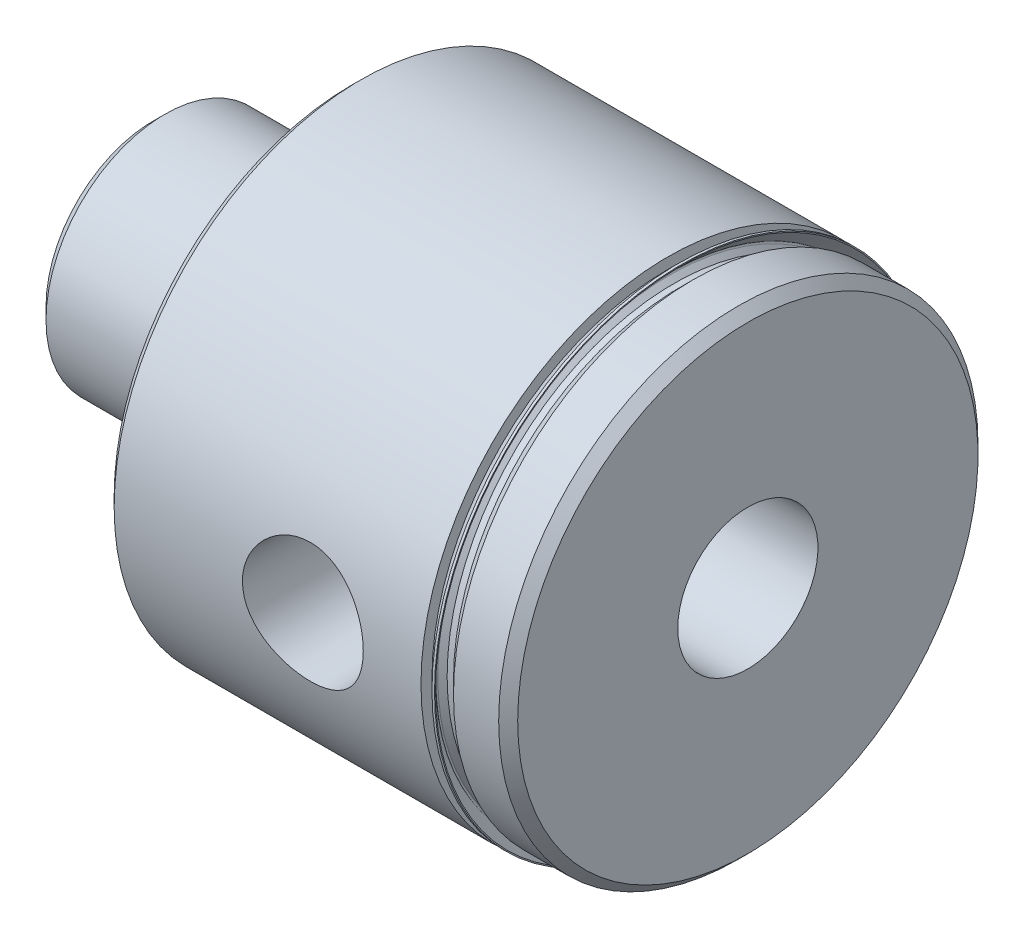
ISO-10303-21;
HEADER;
FILE_DESCRIPTION(('STEP AP214'),'2;1');
FILE_NAME('part.step','',(''),(''),'','','');
FILE_SCHEMA(('AUTOMOTIVE_DESIGN { 1 0 10303 214 1 1 1 1 }'));
ENDSEC;
DATA;
#1=APPLICATION_CONTEXT('core data for automotive mechanical design processes');
#2=APPLICATION_PROTOCOL_DEFINITION('international standard','automotive_design',2000,#1);
#3=PRODUCT_CONTEXT('',#1,'mechanical');
#4=PRODUCT('Part','Part','',(#3));
#5=PRODUCT_RELATED_PRODUCT_CATEGORY('part','',(#4));
#6=PRODUCT_DEFINITION_FORMATION('','',#4);
#7=PRODUCT_DEFINITION_CONTEXT('part definition',#1,'design');
#8=PRODUCT_DEFINITION('design','',#6,#7);
#9=PRODUCT_DEFINITION_SHAPE('','',#8);
#10=(LENGTH_UNIT() NAMED_UNIT(*) SI_UNIT(.MILLI.,.METRE.));
#11=(NAMED_UNIT(*) PLANE_ANGLE_UNIT() SI_UNIT($,.RADIAN.));
#12=(NAMED_UNIT(*) SI_UNIT($,.STERADIAN.) SOLID_ANGLE_UNIT());
#13=UNCERTAINTY_MEASURE_WITH_UNIT(LENGTH_MEASURE(1.E-05),#10,'distance_accuracy_value','');
#14=(GEOMETRIC_REPRESENTATION_CONTEXT(3) GLOBAL_UNCERTAINTY_ASSIGNED_CONTEXT((#13)) GLOBAL_UNIT_ASSIGNED_CONTEXT((#10,
#11,#12)) REPRESENTATION_CONTEXT('',''));
#15=CARTESIAN_POINT('',(0.,0.,0.));
#16=DIRECTION('',(0.,0.,1.));
#17=DIRECTION('',(1.,0.,0.));
#18=AXIS2_PLACEMENT_3D('',#15,#16,#17);
#19=CARTESIAN_POINT('',(41.2115,19.76755,0.));
#20=DIRECTION('',(-1.,0.,0.));
#21=DIRECTION('',(0.,0.,1.));
#22=AXIS2_PLACEMENT_3D('',#19,#20,#21);
#23=PLANE('',#22);
#24=CARTESIAN_POINT('',(41.2115,0.,0.));
#25=DIRECTION('',(-1.,0.,0.));
#26=DIRECTION('',(0.,0.,1.));
#27=AXIS2_PLACEMENT_3D('',#24,#25,#26);
#28=CIRCLE('',#27,19.76755);
#29=CARTESIAN_POINT('',(41.2115,0.,19.76755));
#30=VERTEX_POINT('',#29);
#31=EDGE_CURVE('E120',#30,#30,#28,.T.);
#32=ORIENTED_EDGE('',*,*,#31,.F.);
#33=EDGE_LOOP('',(#32));
#34=FACE_BOUND('',#33,.T.);
#35=CARTESIAN_POINT('',(41.2115,0.,0.));
#36=DIRECTION('',(-1.,0.,0.));
#37=DIRECTION('',(0.,0.,1.));
#38=AXIS2_PLACEMENT_3D('',#35,#36,#37);
#39=CIRCLE('',#38,18.888259175245);
#40=CARTESIAN_POINT('',(41.2115,0.,18.888259175245));
#41=VERTEX_POINT('',#40);
#42=EDGE_CURVE('E10',#41,#41,#39,.F.);
#43=ORIENTED_EDGE('',*,*,#42,.F.);
#44=EDGE_LOOP('',(#43));
#45=FACE_BOUND('',#44,.T.);
#46=ADVANCED_FACE('F36',(#34,#45),#23,.F.);
#47=CARTESIAN_POINT('',(47.625,0.,0.));
#48=DIRECTION('',(-1.,0.,0.));
#49=DIRECTION('',(0.,0.,1.));
#50=AXIS2_PLACEMENT_3D('',#47,#48,#49);
#51=CYLINDRICAL_SURFACE('',#50,18.18005);
#52=CARTESIAN_POINT('',(42.2275,0.,0.));
#53=DIRECTION('',(-1.,0.,0.));
#54=DIRECTION('',(0.,0.,1.));
#55=AXIS2_PLACEMENT_3D('',#52,#53,#54);
#56=CIRCLE('',#55,18.18005);
#57=CARTESIAN_POINT('',(42.2275,0.,18.18005));
#58=VERTEX_POINT('',#57);
#59=EDGE_CURVE('E123',#58,#58,#56,.T.);
#60=ORIENTED_EDGE('',*,*,#59,.T.);
#61=EDGE_LOOP('',(#60));
#62=FACE_BOUND('',#61,.T.);
#63=CARTESIAN_POINT('',(41.7195,0.,0.));
#64=DIRECTION('',(-1.,0.,0.));
#65=DIRECTION('',(0.,0.,1.));
#66=AXIS2_PLACEMENT_3D('',#63,#64,#65);
#67=CIRCLE('',#66,18.18005);
#68=CARTESIAN_POINT('',(41.7195,0.,18.18005));
#69=VERTEX_POINT('',#68);
#70=EDGE_CURVE('E43',#69,#69,#67,.T.);
#71=ORIENTED_EDGE('',*,*,#70,.F.);
#72=EDGE_LOOP('',(#71));
#73=FACE_BOUND('',#72,.T.);
#74=ADVANCED_FACE('F110',(#62,#73),#51,.T.);
#75=CARTESIAN_POINT('',(47.625,0.,0.));
#76=DIRECTION('',(-1.,0.,0.));
#77=DIRECTION('',(0.,0.,1.));
#78=AXIS2_PLACEMENT_3D('',#75,#76,#77);
#79=CYLINDRICAL_SURFACE('',#78,19.76755);
#80=CARTESIAN_POINT('',(16.637,0.,0.));
#81=DIRECTION('',(-1.,0.,0.));
#82=DIRECTION('',(0.,0.,1.));
#83=AXIS2_PLACEMENT_3D('',#80,#81,#82);
#84=CIRCLE('',#83,19.76755);
#85=CARTESIAN_POINT('',(16.637,0.,19.76755));
#86=VERTEX_POINT('',#85);
#87=EDGE_CURVE('E122',#86,#86,#84,.T.);
#88=ORIENTED_EDGE('',*,*,#87,.F.);
#89=EDGE_LOOP('',(#88));
#90=FACE_BOUND('',#89,.T.);
#91=ORIENTED_EDGE('',*,*,#31,.T.);
#92=EDGE_LOOP('',(#91));
#93=FACE_BOUND('',#92,.T.);
#94=CARTESIAN_POINT('',(28.435365081816,-3.51265650317575,19.4529503493223));
#95=CARTESIAN_POINT('',(28.6329278280783,-3.69763911428528,19.4195484578315));
#96=CARTESIAN_POINT('',(28.8461523832951,-3.8660805131461,19.3864045251385));
#97=CARTESIAN_POINT('',(29.2982767694255,-4.16526039848003,19.3243394024906));
#98=CARTESIAN_POINT('',(29.5371903557272,-4.29597854636476,19.2954204946016));
#99=CARTESIAN_POINT('',(30.0344111976161,-4.51592878148575,19.2451350457812));
#100=CARTESIAN_POINT('',(30.2927327479368,-4.60512993491552,19.2237741390568));
#101=CARTESIAN_POINT('',(30.8212362958428,-4.73902603586449,19.1912083718852));
#102=CARTESIAN_POINT('',(31.091414940882,-4.78373348022602,19.1800006598137));
#103=CARTESIAN_POINT('',(31.630627161756,-4.82676103183334,19.1692174197079));
#104=CARTESIAN_POINT('',(31.8995893709715,-4.82592441675557,19.1694304285267));
#105=CARTESIAN_POINT('',(32.4334566613178,-4.77998645132883,19.1809360417537));
#106=CARTESIAN_POINT('',(32.6983617925494,-4.73488564804683,19.1922285092294));
#107=CARTESIAN_POINT('',(33.2141373097179,-4.60252491595889,19.2243941628857));
#108=CARTESIAN_POINT('',(33.4651152033048,-4.5156604777289,19.2451773832846));
#109=CARTESIAN_POINT('',(33.9489993997335,-4.3025515462851,19.2939361087814));
#110=CARTESIAN_POINT('',(34.1819033976118,-4.17630204056709,19.321912529272));
#111=CARTESIAN_POINT('',(34.6282945618301,-3.88488055179608,19.3826282081787));
#112=CARTESIAN_POINT('',(34.8412767286942,-3.71895317869879,19.415454475128));
#113=CARTESIAN_POINT('',(35.2366729936586,-3.35406634411163,19.4818015571243));
#114=CARTESIAN_POINT('',(35.4190833363315,-3.15510283044633,19.5153224569323));
#115=CARTESIAN_POINT('',(35.7511715111366,-2.72568801269662,19.5799514409178));
#116=CARTESIAN_POINT('',(35.9002527135169,-2.49476691186133,19.611009962086));
#117=CARTESIAN_POINT('',(36.1572439441031,-2.01031843546389,19.6665706414187));
#118=CARTESIAN_POINT('',(36.2651587711716,-1.756793699115,19.6910735636855));
#119=CARTESIAN_POINT('',(36.4349032225895,-1.23859032196555,19.7303904621238));
#120=CARTESIAN_POINT('',(36.4974498136582,-0.974158321983477,19.7453546987443));
#121=CARTESIAN_POINT('',(36.5771093875624,-0.43817138420285,19.7645106115859));
#122=CARTESIAN_POINT('',(36.5942308239995,-0.166617781232319,19.7687042921982));
#123=CARTESIAN_POINT('',(36.5826094638717,0.368142985725246,19.7658827120028));
#124=CARTESIAN_POINT('',(36.5550815152975,0.631379071573977,19.7591643460427));
#125=CARTESIAN_POINT('',(36.4573784979057,1.1493417179025,19.7358121128105));
#126=CARTESIAN_POINT('',(36.3872032393555,1.40406824051897,19.7191782014254));
#127=CARTESIAN_POINT('',(36.20639161497,1.89822862606427,19.677762892548));
#128=CARTESIAN_POINT('',(36.0957215972578,2.13764957483144,19.6529747204527));
#129=CARTESIAN_POINT('',(35.837207806796,2.59480171047055,19.5978601353498));
#130=CARTESIAN_POINT('',(35.6893581937111,2.81252948217283,19.5675328524392));
#131=CARTESIAN_POINT('',(35.356034329401,3.22643047339813,19.5036218391906));
#132=CARTESIAN_POINT('',(35.1696504349527,3.42186124178595,19.4699722082067));
#133=CARTESIAN_POINT('',(34.7668632401047,3.77912170302543,19.4037975687667));
#134=CARTESIAN_POINT('',(34.5504563796814,3.94094740540965,19.3712726942526));
#135=CARTESIAN_POINT('',(34.0895860496967,4.22894103774358,19.3104679954526));
#136=CARTESIAN_POINT('',(33.8447283307059,4.3544955777866,19.2822646045092));
#137=CARTESIAN_POINT('',(33.3366256252978,4.56262704775068,19.2340833038405));
#138=CARTESIAN_POINT('',(33.0733832244848,4.64521000740383,19.2141042401674));
#139=CARTESIAN_POINT('',(32.5406394056792,4.76371146458682,19.1850666945539));
#140=CARTESIAN_POINT('',(32.2713163473849,4.80038744704197,19.1758311259643));
#141=CARTESIAN_POINT('',(31.7301931801441,4.82834722752884,19.1688112712599));
#142=CARTESIAN_POINT('',(31.4583934012672,4.81963698830482,19.1710254808974));
#143=CARTESIAN_POINT('',(30.9258578691795,4.75777986051021,19.1864668890865));
#144=CARTESIAN_POINT('',(30.6650095220289,4.70553893930104,19.1994695336789));
#145=CARTESIAN_POINT('',(30.1558920557396,4.55946875033867,19.2346788846883));
#146=CARTESIAN_POINT('',(29.9076238683241,4.46563640720602,19.2568862717203));
#147=CARTESIAN_POINT('',(29.4277871838305,4.2379864197375,19.3082674520253));
#148=CARTESIAN_POINT('',(29.1964171578653,4.10376666251472,19.3375106807538));
#149=CARTESIAN_POINT('',(28.7591799812249,3.79940157683792,19.3996041291334));
#150=CARTESIAN_POINT('',(28.5533168737152,3.62925056436098,19.4324549190753));
#151=CARTESIAN_POINT('',(28.1678199863334,3.25295244141874,19.499016030879));
#152=CARTESIAN_POINT('',(27.9889295753611,3.04604306859441,19.5327281525631));
#153=CARTESIAN_POINT('',(27.6684203590344,2.60460345340952,19.5964722725483));
#154=CARTESIAN_POINT('',(27.526801331945,2.37007337538216,19.6265042927425));
#155=CARTESIAN_POINT('',(27.2853814922027,1.88028127444305,19.6794573161784));
#156=CARTESIAN_POINT('',(27.1854868457201,1.62506732901444,19.7023942450575));
#157=CARTESIAN_POINT('',(27.0303815768316,1.10076483356896,19.7386246450477));
#158=CARTESIAN_POINT('',(26.9751611196866,0.831679351165157,19.7519202385707));
#159=CARTESIAN_POINT('',(26.9122213961598,0.295282285694851,19.7671149914487));
#160=CARTESIAN_POINT('',(26.9032268815798,0.0281285750742939,19.7693200706738));
#161=CARTESIAN_POINT('',(26.9296091709244,-0.50385988489081,19.7629175554801));
#162=CARTESIAN_POINT('',(26.9649869116482,-0.768694585156912,19.7543097327762));
#163=CARTESIAN_POINT('',(27.0781356723665,-1.28492103944122,19.7274177433937));
#164=CARTESIAN_POINT('',(27.1553431250623,-1.5364437690449,19.7092623041115));
#165=CARTESIAN_POINT('',(27.3493194364399,-2.02291155997901,19.6652868574562));
#166=CARTESIAN_POINT('',(27.4660727854644,-2.25786307685637,19.6394698553918));
#167=CARTESIAN_POINT('',(27.71549644764,-2.67173781743904,19.5871061222848));
#168=CARTESIAN_POINT('',(27.8431733101079,-2.85378481366746,19.5612462333185));
#169=CARTESIAN_POINT('',(28.122183547356,-3.19847479248924,19.5078500664681));
#170=CARTESIAN_POINT('',(28.2735189032132,-3.3611161481115,19.4803136483155));
#171=CARTESIAN_POINT('',(28.435365081816,-3.51265650317575,19.4529503493223));
#172=B_SPLINE_CURVE_WITH_KNOTS('',3,(#94,#95,#96,#97,#98,#99,#100,#101,#102,#103,#104,#105,#106,
#107,#108,#109,#110,#111,#112,#113,#114,#115,#116,#117,#118,#119,#120,#121,#122,#123,#124,#125,
#126,#127,#128,#129,#130,#131,#132,#133,#134,#135,#136,#137,#138,#139,#140,#141,#142,#143,#144,
#145,#146,#147,#148,#149,#150,#151,#152,#153,#154,#155,#156,#157,#158,#159,#160,#161,#162,#163,
#164,#165,#166,#167,#168,#169,#170,#171),.UNSPECIFIED.,.T.,.F.,(4,2,2,2,2,2,2,2,2,2,2,2,2,2,2,2,
2,2,2,2,2,2,2,2,2,2,2,2,2,2,2,2,2,2,2,2,2,2,4),(0.,0.817314073620869,1.63506798447687,
2.4534302222361,3.27156254361548,4.07455186240763,4.8775312570733,5.67305209525232,
6.46867422002776,7.28085528321948,8.09313604130971,8.91896356729549,9.74469479515468,
10.5570742328157,11.369302476408,12.1597994363369,12.9502999131154,13.7414588075947,
14.532742058532,15.3454316232512,16.1582176364985,16.9840368466382,17.8097401473271,
18.6216312588531,19.4334157085595,20.2287152433845,21.0240735945681,21.8276287134212,
22.6313110432991,23.4541767979964,24.2770376571882,25.0980378916828,25.918857338973,
26.7169061884853,27.5149718869051,28.3025434253844,29.0898064401128,29.7593055255743,
30.4288607025318),.UNSPECIFIED.);
#173=CARTESIAN_POINT('',(28.435365081816,-3.51265650317575,19.4529503493223));
#174=VERTEX_POINT('',#173);
#175=EDGE_CURVE('E47',#174,#174,#172,.T.);
#176=ORIENTED_EDGE('',*,*,#175,.F.);
#177=EDGE_LOOP('',(#176));
#178=FACE_BOUND('',#177,.T.);
#179=ADVANCED_FACE('F64',(#90,#93,#178),#79,.T.);
#180=CARTESIAN_POINT('',(47.625,0.,0.));
#181=DIRECTION('',(-1.,0.,0.));
#182=DIRECTION('',(0.,0.,1.));
#183=AXIS2_PLACEMENT_3D('',#180,#181,#182);
#184=CYLINDRICAL_SURFACE('',#183,5.6134);
#185=CARTESIAN_POINT('',(47.625,0.,0.));
#186=DIRECTION('',(-1.,0.,0.));
#187=DIRECTION('',(0.,0.,1.));
#188=AXIS2_PLACEMENT_3D('',#185,#186,#187);
#189=CIRCLE('',#188,5.6134);
#190=CARTESIAN_POINT('',(47.625,0.,5.6134));
#191=VERTEX_POINT('',#190);
#192=EDGE_CURVE('E485',#191,#191,#189,.T.);
#193=ORIENTED_EDGE('',*,*,#192,.F.);
#194=EDGE_LOOP('',(#193));
#195=FACE_BOUND('',#194,.T.);
#196=CARTESIAN_POINT('',(0.761999999999999,0.,0.));
#197=DIRECTION('',(-1.,0.,0.));
#198=DIRECTION('',(0.,0.,1.));
#199=AXIS2_PLACEMENT_3D('',#196,#197,#198);
#200=CIRCLE('',#199,5.6134);
#201=CARTESIAN_POINT('',(0.761999999999999,0.,5.6134));
#202=VERTEX_POINT('',#201);
#203=EDGE_CURVE('E488',#202,#202,#200,.T.);
#204=ORIENTED_EDGE('',*,*,#203,.T.);
#205=EDGE_LOOP('',(#204));
#206=FACE_BOUND('',#205,.T.);
#207=CARTESIAN_POINT('',(34.925,0.,5.6134));
#208=CARTESIAN_POINT('',(34.9249998579023,0.0821623693349804,5.61339995699838));
#209=CARTESIAN_POINT('',(34.9218051359041,0.164320513889019,5.61159065214013));
#210=CARTESIAN_POINT('',(34.9090814661473,0.327995279330299,5.60440967825438));
#211=CARTESIAN_POINT('',(34.8995504492879,0.409511681857266,5.59903684556736));
#212=CARTESIAN_POINT('',(34.8616097743609,0.652081627692676,5.57774779539357));
#213=CARTESIAN_POINT('',(34.8238521366127,0.811338029816947,5.55666060930794));
#214=CARTESIAN_POINT('',(34.7254246715626,1.1196591009717,5.50282798498081));
#215=CARTESIAN_POINT('',(34.6648395967703,1.2687590894302,5.47012569612708));
#216=CARTESIAN_POINT('',(34.5230636232286,1.55440526348606,5.39591227930169));
#217=CARTESIAN_POINT('',(34.4418675936104,1.69094831162539,5.35439895834356));
#218=CARTESIAN_POINT('',(34.2547143605698,1.95845765966252,5.26270844927263));
#219=CARTESIAN_POINT('',(34.1474069572226,2.08833692764613,5.21212508879652));
#220=CARTESIAN_POINT('',(33.9140569239964,2.32930354211221,5.10899359943267));
#221=CARTESIAN_POINT('',(33.7879945230462,2.44037078994657,5.05644344148403));
#222=CARTESIAN_POINT('',(33.504882480484,2.65245775268943,4.94876899543653));
#223=CARTESIAN_POINT('',(33.3459646844461,2.7511649183057,4.89396219071688));
#224=CARTESIAN_POINT('',(33.0106076339825,2.92003380267968,4.79513183911936));
#225=CARTESIAN_POINT('',(32.8341947885826,2.99023775531915,4.75109237682188));
#226=CARTESIAN_POINT('',(32.5081085203762,3.08677877117435,4.68877513505459));
#227=CARTESIAN_POINT('',(32.3609482301036,3.11933139320781,4.66697971465572));
#228=CARTESIAN_POINT('',(32.062174173554,3.16321149440602,4.6373576092683));
#229=CARTESIAN_POINT('',(31.9105651976561,3.17456101071162,4.62951642155263));
#230=CARTESIAN_POINT('',(31.6070694166165,3.17541450648967,4.62893102770911));
#231=CARTESIAN_POINT('',(31.4551825021945,3.16489092366436,4.63620586929009));
#232=CARTESIAN_POINT('',(31.1557383283429,3.12255993267885,4.66481557633946));
#233=CARTESIAN_POINT('',(31.0081840539181,3.09073819423309,4.68615990820008));
#234=CARTESIAN_POINT('',(30.7213592656859,3.00745687900315,4.74002995044834));
#235=CARTESIAN_POINT('',(30.5820705370745,2.95604248858711,4.77252991570124));
#236=CARTESIAN_POINT('',(30.3136541723933,2.83535200958952,4.84520308215602));
#237=CARTESIAN_POINT('',(30.1845304845011,2.76606902495452,4.88537924428915));
#238=CARTESIAN_POINT('',(29.9185539754628,2.59900192815599,4.97652910443213));
#239=CARTESIAN_POINT('',(29.7836777474499,2.49844939981214,5.02820730750219));
#240=CARTESIAN_POINT('',(29.531461845307,2.27747390969321,5.1320877118306));
#241=CARTESIAN_POINT('',(29.4141368708698,2.15703446766699,5.184290313675));
#242=CARTESIAN_POINT('',(29.1874224378805,1.88376954375588,5.29011416577329));
#243=CARTESIAN_POINT('',(29.0802977235085,1.72884386148078,5.34326809463976));
#244=CARTESIAN_POINT('',(28.94070761533,1.48238030822901,5.41481160729082));
#245=CARTESIAN_POINT('',(28.8976811279881,1.39784437015664,5.43730202634795));
#246=CARTESIAN_POINT('',(28.8191226254188,1.22458602807581,5.47891971352667));
#247=CARTESIAN_POINT('',(28.783586095122,1.13586618589834,5.49804900662658));
#248=CARTESIAN_POINT('',(28.7226722308014,0.961180402024894,5.53116102266396));
#249=CARTESIAN_POINT('',(28.696761149947,0.87545038183479,5.54540871504812));
#250=CARTESIAN_POINT('',(28.6521959792515,0.701626536182391,5.57006998084775));
#251=CARTESIAN_POINT('',(28.6335380099381,0.613534001388016,5.58048560376228));
#252=CARTESIAN_POINT('',(28.6037525571766,0.435737446747216,5.59717370826138));
#253=CARTESIAN_POINT('',(28.5926210004367,0.346034325578978,5.60344843085562));
#254=CARTESIAN_POINT('',(28.5780437509341,0.165839982664669,5.61167630889777));
#255=CARTESIAN_POINT('',(28.5745972374804,0.0753488461075207,5.61362992579932));
#256=CARTESIAN_POINT('',(28.5758093772984,-0.174583996889071,5.61293847555329));
#257=CARTESIAN_POINT('',(28.5886358891678,-0.334071783644838,5.60566022957548));
#258=CARTESIAN_POINT('',(28.6377820254482,-0.648103262439577,5.57809452559714));
#259=CARTESIAN_POINT('',(28.674102193285,-0.802646840028516,5.55780676667696));
#260=CARTESIAN_POINT('',(28.7681869112593,-1.10172711361315,5.50629732611813));
#261=CARTESIAN_POINT('',(28.8257832746561,-1.24633201539081,5.47516150446489));
#262=CARTESIAN_POINT('',(28.9603655920564,-1.52393967562467,5.40448155117352));
#263=CARTESIAN_POINT('',(29.037356403376,-1.65693951635579,5.36493531354388));
#264=CARTESIAN_POINT('',(29.2175639746098,-1.92243070943738,5.27599210831586));
#265=CARTESIAN_POINT('',(29.322673637778,-2.05343578030353,5.22599869425569));
#266=CARTESIAN_POINT('',(29.5516887816742,-2.29696386299473,5.12364194197683));
#267=CARTESIAN_POINT('',(29.6756155030866,-2.40946568556823,5.07127597308856));
#268=CARTESIAN_POINT('',(29.9544974447345,-2.625094802698,4.96338330060658));
#269=CARTESIAN_POINT('',(30.1113564524656,-2.72591153444098,4.90812262432982));
#270=CARTESIAN_POINT('',(30.4428125411621,-2.89944000724207,4.80766134429477));
#271=CARTESIAN_POINT('',(30.6173849857137,-2.97219012547718,4.76244703968003));
#272=CARTESIAN_POINT('',(30.9415942277655,-3.07401157882498,4.69718724903205));
#273=CARTESIAN_POINT('',(31.0886836484926,-3.10906992450446,4.67383958626922));
#274=CARTESIAN_POINT('',(31.3878077894682,-3.15790146031213,4.64099309224391));
#275=CARTESIAN_POINT('',(31.5398369506483,-3.17169778517904,4.63147920938677));
#276=CARTESIAN_POINT('',(31.8447547230325,-3.17725338732108,4.62767071186645));
#277=CARTESIAN_POINT('',(31.9976443607764,-3.16897484778946,4.63340221427744));
#278=CARTESIAN_POINT('',(32.2994761100531,-3.13079490920484,4.65927981058093));
#279=CARTESIAN_POINT('',(32.448415640636,-3.10087971711801,4.67943509932923));
#280=CARTESIAN_POINT('',(32.7368248367288,-3.02141291547972,4.73112132971286));
#281=CARTESIAN_POINT('',(32.8763856719801,-2.97209774057715,4.76251490624142));
#282=CARTESIAN_POINT('',(33.1456249813082,-2.8555915344253,4.83326937464131));
#283=CARTESIAN_POINT('',(33.2752997080469,-2.78839376767878,4.87263326720189));
#284=CARTESIAN_POINT('',(33.5422084997231,-2.62613578705629,4.96220653197006));
#285=CARTESIAN_POINT('',(33.677561882322,-2.52838526398892,5.01315372940073));
#286=CARTESIAN_POINT('',(33.9312040900675,-2.31315811275706,5.11603656683268));
#287=CARTESIAN_POINT('',(34.0494788070713,-2.1956653475302,5.16797298436634));
#288=CARTESIAN_POINT('',(34.2796251062276,-1.92775741716748,5.27418452421595));
#289=CARTESIAN_POINT('',(34.3891364595098,-1.77509997176914,5.3280246204245));
#290=CARTESIAN_POINT('',(34.5326571593358,-1.53177908465099,5.4010314552227));
#291=CARTESIAN_POINT('',(34.5770561452431,-1.44823905178625,5.42408413489763));
#292=CARTESIAN_POINT('',(34.6584746076697,-1.27686406563405,5.4669604093337));
#293=CARTESIAN_POINT('',(34.6954983511241,-1.18903163255535,5.48678586997627));
#294=CARTESIAN_POINT('',(34.7606515248021,-1.01251042042715,5.52204053165217));
#295=CARTESIAN_POINT('',(34.7890232695167,-0.923934681391812,5.53758800601035));
#296=CARTESIAN_POINT('',(34.8379811829612,-0.744093029789211,5.56460645282066));
#297=CARTESIAN_POINT('',(34.8585716140312,-0.652828619605574,5.5760796568118));
#298=CARTESIAN_POINT('',(34.891646678541,-0.46845248086365,5.59458580978861));
#299=CARTESIAN_POINT('',(34.9041361845415,-0.375341897546174,5.60162142783206));
#300=CARTESIAN_POINT('',(34.9208123777646,-0.188152276859621,5.6110282392154));
#301=CARTESIAN_POINT('',(34.9250001626974,-0.0940733691828537,5.61340004923552));
#302=CARTESIAN_POINT('',(34.925,0.,5.6134));
#303=B_SPLINE_CURVE_WITH_KNOTS('',3,(#207,#208,#209,#210,#211,#212,#213,#214,#215,#216,#217,
#218,#219,#220,#221,#222,#223,#224,#225,#226,#227,#228,#229,#230,#231,#232,#233,#234,#235,#236,
#237,#238,#239,#240,#241,#242,#243,#244,#245,#246,#247,#248,#249,#250,#251,#252,#253,#254,#255,
#256,#257,#258,#259,#260,#261,#262,#263,#264,#265,#266,#267,#268,#269,#270,#271,#272,#273,#274,
#275,#276,#277,#278,#279,#280,#281,#282,#283,#284,#285,#286,#287,#288,#289,#290,#291,#292,#293,
#294,#295,#296,#297,#298,#299,#300,#301,#302),.UNSPECIFIED.,.T.,.F.,(4,2,2,2,2,2,2,2,2,2,2,2,2,
2,2,2,2,2,2,2,2,2,2,2,2,2,2,2,2,2,2,2,2,2,2,2,2,2,2,2,2,2,2,2,2,2,2,4),(0.,0.246389107575224,
0.49285871242746,0.985259173450996,1.47584920765582,1.96656148878411,2.49216874007467,
3.01833405240715,3.60026598356831,4.18133247771155,4.63620867252141,5.09061183476255,
5.54558793766704,6.00087047559118,6.45510929250011,6.90952367749083,7.43538208138259,
7.96167847067522,8.54543274549417,8.83753694560908,9.12946455367089,9.40114046431933,
9.67267086306319,9.94405419177241,10.2154085378833,10.693342364036,11.1712872455506,
11.6455321524318,12.1198959516685,12.643507174172,13.1677139040996,13.7483150461528,
14.3281194593634,14.7851501714349,15.2416832464326,15.6989989178594,16.1566063782507,
16.608801484326,17.061167151824,17.5827687787249,18.1047988489815,18.6877837852989,
18.9795590964415,19.2711651080098,19.5536352357359,19.8359504108384,20.118095620585,
20.4002035206756),.UNSPECIFIED.);
#304=CARTESIAN_POINT('',(34.925,0.,5.6134));
#305=VERTEX_POINT('',#304);
#306=EDGE_CURVE('E58',#305,#305,#303,.T.);
#307=ORIENTED_EDGE('',*,*,#306,.T.);
#308=EDGE_LOOP('',(#307));
#309=FACE_BOUND('',#308,.T.);
#310=ADVANCED_FACE('F84',(#195,#206,#309),#184,.F.);
#311=CARTESIAN_POINT('',(0.,0.,0.));
#312=DIRECTION('',(1.,0.,0.));
#313=DIRECTION('',(0.,0.,-1.));
#314=AXIS2_PLACEMENT_3D('',#311,#312,#313);
#315=PLANE('',#314);
#316=CARTESIAN_POINT('',(0.,0.,0.));
#317=DIRECTION('',(-1.,0.,0.));
#318=DIRECTION('',(0.,0.,1.));
#319=AXIS2_PLACEMENT_3D('',#316,#317,#318);
#320=CIRCLE('',#319,8.58901);
#321=CARTESIAN_POINT('',(0.,0.,8.58901));
#322=VERTEX_POINT('',#321);
#323=EDGE_CURVE('E138',#322,#322,#320,.T.);
#324=ORIENTED_EDGE('',*,*,#323,.T.);
#325=EDGE_LOOP('',(#324));
#326=FACE_BOUND('',#325,.T.);
#327=CARTESIAN_POINT('',(0.,0.,0.));
#328=DIRECTION('',(-1.,0.,0.));
#329=DIRECTION('',(0.,0.,1.));
#330=AXIS2_PLACEMENT_3D('',#327,#328,#329);
#331=CIRCLE('',#330,6.3754);
#332=CARTESIAN_POINT('',(0.,0.,6.3754));
#333=VERTEX_POINT('',#332);
#334=EDGE_CURVE('E491',#333,#333,#331,.T.);
#335=ORIENTED_EDGE('',*,*,#334,.F.);
#336=EDGE_LOOP('',(#335));
#337=FACE_BOUND('',#336,.T.);
#338=ADVANCED_FACE('F88',(#326,#337),#315,.F.);
#339=CARTESIAN_POINT('',(47.625,18.43405,0.));
#340=DIRECTION('',(-1.,0.,0.));
#341=DIRECTION('',(0.,0.,1.));
#342=AXIS2_PLACEMENT_3D('',#339,#340,#341);
#343=PLANE('',#342);
#344=CARTESIAN_POINT('',(47.625,0.,0.));
#345=DIRECTION('',(-1.,0.,0.));
#346=DIRECTION('',(0.,0.,1.));
#347=AXIS2_PLACEMENT_3D('',#344,#345,#346);
#348=CIRCLE('',#347,18.43405);
#349=CARTESIAN_POINT('',(47.625,0.,18.43405));
#350=VERTEX_POINT('',#349);
#351=EDGE_CURVE('E494',#350,#350,#348,.T.);
#352=ORIENTED_EDGE('',*,*,#351,.F.);
#353=EDGE_LOOP('',(#352));
#354=FACE_BOUND('',#353,.T.);
#355=ORIENTED_EDGE('',*,*,#192,.T.);
#356=EDGE_LOOP('',(#355));
#357=FACE_BOUND('',#356,.T.);
#358=ADVANCED_FACE('F94',(#354,#357),#343,.F.);
#359=CARTESIAN_POINT('',(15.875,0.,0.));
#360=DIRECTION('',(-1.,0.,0.));
#361=DIRECTION('',(0.,0.,1.));
#362=AXIS2_PLACEMENT_3D('',#359,#360,#361);
#363=CYLINDRICAL_SURFACE('',#362,9.49325);
#364=CARTESIAN_POINT('',(13.4874,0.,0.));
#365=DIRECTION('',(-1.,0.,0.));
#366=DIRECTION('',(0.,0.,1.));
#367=AXIS2_PLACEMENT_3D('',#364,#365,#366);
#368=CIRCLE('',#367,9.49325);
#369=CARTESIAN_POINT('',(13.4874,0.,9.49325));
#370=VERTEX_POINT('',#369);
#371=EDGE_CURVE('E51',#370,#370,#368,.T.);
#372=ORIENTED_EDGE('',*,*,#371,.F.);
#373=EDGE_LOOP('',(#372));
#374=FACE_BOUND('',#373,.T.);
#375=CARTESIAN_POINT('',(15.875,0.,0.));
#376=DIRECTION('',(1.,0.,0.));
#377=DIRECTION('',(0.,0.,-1.));
#378=AXIS2_PLACEMENT_3D('',#375,#376,#377);
#379=CIRCLE('',#378,9.49325);
#380=CARTESIAN_POINT('',(15.875,0.,-9.49325));
#381=VERTEX_POINT('',#380);
#382=EDGE_CURVE('E135',#381,#381,#379,.T.);
#383=ORIENTED_EDGE('',*,*,#382,.F.);
#384=EDGE_LOOP('',(#383));
#385=FACE_BOUND('',#384,.T.);
#386=ADVANCED_FACE('F38',(#374,#385),#363,.T.);
#387=CARTESIAN_POINT('',(13.4874,9.41705,0.));
#388=DIRECTION('',(1.,0.,0.));
#389=DIRECTION('',(0.,0.,-1.));
#390=AXIS2_PLACEMENT_3D('',#387,#388,#389);
#391=PLANE('',#390);
#392=CARTESIAN_POINT('',(13.4874,0.,0.));
#393=DIRECTION('',(-1.,0.,0.));
#394=DIRECTION('',(0.,0.,1.));
#395=AXIS2_PLACEMENT_3D('',#392,#393,#394);
#396=CIRCLE('',#395,9.41705);
#397=CARTESIAN_POINT('',(13.4874,0.,9.41705));
#398=VERTEX_POINT('',#397);
#399=EDGE_CURVE('E156',#398,#398,#396,.T.);
#400=ORIENTED_EDGE('',*,*,#399,.F.);
#401=EDGE_LOOP('',(#400));
#402=FACE_BOUND('',#401,.T.);
#403=ORIENTED_EDGE('',*,*,#371,.T.);
#404=EDGE_LOOP('',(#403));
#405=FACE_BOUND('',#404,.T.);
#406=ADVANCED_FACE('F161',(#402,#405),#391,.F.);
#407=CARTESIAN_POINT('',(12.3697999999999,0.,0.));
#408=DIRECTION('',(-1.,0.,0.));
#409=DIRECTION('',(0.,0.,1.));
#410=AXIS2_PLACEMENT_3D('',#407,#408,#409);
#411=TOROIDAL_SURFACE('',#410,9.41705000000012,1.11760000000012);
#412=CARTESIAN_POINT('',(12.3698,0.,0.));
#413=DIRECTION('',(-1.,0.,0.));
#414=DIRECTION('',(0.,0.,1.));
#415=AXIS2_PLACEMENT_3D('',#412,#413,#414);
#416=CIRCLE('',#415,8.29945);
#417=CARTESIAN_POINT('',(12.3698,0.,8.29945));
#418=VERTEX_POINT('',#417);
#419=EDGE_CURVE('E153',#418,#418,#416,.T.);
#420=ORIENTED_EDGE('',*,*,#419,.F.);
#421=EDGE_LOOP('',(#420));
#422=FACE_BOUND('',#421,.T.);
#423=ORIENTED_EDGE('',*,*,#399,.T.);
#424=EDGE_LOOP('',(#423));
#425=FACE_BOUND('',#424,.T.);
#426=ADVANCED_FACE('F198',(#422,#425),#411,.F.);
#427=CARTESIAN_POINT('',(15.875,0.,0.));
#428=DIRECTION('',(-1.,0.,0.));
#429=DIRECTION('',(0.,0.,1.));
#430=AXIS2_PLACEMENT_3D('',#427,#428,#429);
#431=CYLINDRICAL_SURFACE('',#430,8.29945);
#432=CARTESIAN_POINT('',(11.0362999999995,0.,0.));
#433=DIRECTION('',(-1.,0.,0.));
#434=DIRECTION('',(0.,0.,1.));
#435=AXIS2_PLACEMENT_3D('',#432,#433,#434);
#436=CIRCLE('',#435,8.29945);
#437=CARTESIAN_POINT('',(11.0362999999995,0.,8.29945));
#438=VERTEX_POINT('',#437);
#439=EDGE_CURVE('E150',#438,#438,#436,.T.);
#440=ORIENTED_EDGE('',*,*,#439,.F.);
#441=EDGE_LOOP('',(#440));
#442=FACE_BOUND('',#441,.T.);
#443=ORIENTED_EDGE('',*,*,#419,.T.);
#444=EDGE_LOOP('',(#443));
#445=FACE_BOUND('',#444,.T.);
#446=ADVANCED_FACE('F194',(#442,#445),#431,.T.);
#447=CARTESIAN_POINT('',(11.0362999999995,0.,0.));
#448=DIRECTION('',(-1.,0.,0.));
#449=DIRECTION('',(0.,0.,1.));
#450=AXIS2_PLACEMENT_3D('',#447,#448,#449);
#451=TOROIDAL_SURFACE('',#450,9.41704999999865,1.11759999999865);
#452=CARTESIAN_POINT('',(10.2623331868814,0.,0.));
#453=DIRECTION('',(-1.,0.,0.));
#454=DIRECTION('',(0.,0.,1.));
#455=AXIS2_PLACEMENT_3D('',#452,#453,#454);
#456=CIRCLE('',#455,8.6108210423267);
#457=CARTESIAN_POINT('',(10.2623331868814,0.,8.6108210423267));
#458=VERTEX_POINT('',#457);
#459=EDGE_CURVE('E147',#458,#458,#456,.T.);
#460=ORIENTED_EDGE('',*,*,#459,.F.);
#461=EDGE_LOOP('',(#460));
#462=FACE_BOUND('',#461,.T.);
#463=ORIENTED_EDGE('',*,*,#439,.T.);
#464=EDGE_LOOP('',(#463));
#465=FACE_BOUND('',#464,.T.);
#466=ADVANCED_FACE('F190',(#462,#465),#451,.F.);
#467=CARTESIAN_POINT('',(10.2623331868814,0.,0.));
#468=DIRECTION('',(-1.,0.,0.));
#469=DIRECTION('',(0.,0.,1.));
#470=AXIS2_PLACEMENT_3D('',#467,#468,#469);
#471=CONICAL_SURFACE('',#470,8.6108210423267,0.764984450361304);
#472=CARTESIAN_POINT('',(9.3100474613459,0.,0.));
#473=DIRECTION('',(-1.,0.,0.));
#474=DIRECTION('',(0.,0.,1.));
#475=AXIS2_PLACEMENT_3D('',#472,#473,#474);
#476=CIRCLE('',#475,9.525);
#477=CARTESIAN_POINT('',(9.3100474613459,0.,9.525));
#478=VERTEX_POINT('',#477);
#479=EDGE_CURVE('E144',#478,#478,#476,.T.);
#480=ORIENTED_EDGE('',*,*,#479,.F.);
#481=EDGE_LOOP('',(#480));
#482=FACE_BOUND('',#481,.T.);
#483=ORIENTED_EDGE('',*,*,#459,.T.);
#484=EDGE_LOOP('',(#483));
#485=FACE_BOUND('',#484,.T.);
#486=ADVANCED_FACE('F186',(#482,#485),#471,.T.);
#487=CARTESIAN_POINT('',(15.875,0.,0.));
#488=DIRECTION('',(-1.,0.,0.));
#489=DIRECTION('',(0.,0.,1.));
#490=AXIS2_PLACEMENT_3D('',#487,#488,#489);
#491=CYLINDRICAL_SURFACE('',#490,9.525);
#492=CARTESIAN_POINT('',(0.935989999999999,0.,0.));
#493=DIRECTION('',(-1.,0.,0.));
#494=DIRECTION('',(0.,0.,1.));
#495=AXIS2_PLACEMENT_3D('',#492,#493,#494);
#496=CIRCLE('',#495,9.525);
#497=CARTESIAN_POINT('',(0.935989999999999,0.,9.525));
#498=VERTEX_POINT('',#497);
#499=EDGE_CURVE('E141',#498,#498,#496,.T.);
#500=ORIENTED_EDGE('',*,*,#499,.F.);
#501=EDGE_LOOP('',(#500));
#502=FACE_BOUND('',#501,.T.);
#503=ORIENTED_EDGE('',*,*,#479,.T.);
#504=EDGE_LOOP('',(#503));
#505=FACE_BOUND('',#504,.T.);
#506=ADVANCED_FACE('F177',(#502,#505),#491,.T.);
#507=CARTESIAN_POINT('',(0.935989999999999,0.,0.));
#508=DIRECTION('',(1.,0.,0.));
#509=DIRECTION('',(0.,0.,-1.));
#510=AXIS2_PLACEMENT_3D('',#507,#508,#509);
#511=CONICAL_SURFACE('',#510,9.525,0.785398163397449);
#512=ORIENTED_EDGE('',*,*,#323,.F.);
#513=EDGE_LOOP('',(#512));
#514=FACE_BOUND('',#513,.T.);
#515=ORIENTED_EDGE('',*,*,#499,.T.);
#516=EDGE_LOOP('',(#515));
#517=FACE_BOUND('',#516,.T.);
#518=ADVANCED_FACE('F169',(#514,#517),#511,.T.);
#519=CARTESIAN_POINT('',(15.875,0.,0.));
#520=DIRECTION('',(1.,0.,0.));
#521=DIRECTION('',(0.,0.,-1.));
#522=AXIS2_PLACEMENT_3D('',#519,#520,#521);
#523=PLANE('',#522);
#524=CARTESIAN_POINT('',(15.875,0.,0.));
#525=DIRECTION('',(-1.,0.,0.));
#526=DIRECTION('',(0.,0.,1.));
#527=AXIS2_PLACEMENT_3D('',#524,#525,#526);
#528=CIRCLE('',#527,19.00555);
#529=CARTESIAN_POINT('',(15.875,0.,19.00555));
#530=VERTEX_POINT('',#529);
#531=EDGE_CURVE('E126',#530,#530,#528,.T.);
#532=ORIENTED_EDGE('',*,*,#531,.T.);
#533=EDGE_LOOP('',(#532));
#534=FACE_BOUND('',#533,.T.);
#535=ORIENTED_EDGE('',*,*,#382,.T.);
#536=EDGE_LOOP('',(#535));
#537=FACE_BOUND('',#536,.T.);
#538=ADVANCED_FACE('F167',(#534,#537),#523,.F.);
#539=CARTESIAN_POINT('',(16.637,0.,0.));
#540=DIRECTION('',(1.,0.,0.));
#541=DIRECTION('',(0.,0.,-1.));
#542=AXIS2_PLACEMENT_3D('',#539,#540,#541);
#543=CONICAL_SURFACE('',#542,19.76755,0.785398163397448);
#544=ORIENTED_EDGE('',*,*,#531,.F.);
#545=EDGE_LOOP('',(#544));
#546=FACE_BOUND('',#545,.T.);
#547=ORIENTED_EDGE('',*,*,#87,.T.);
#548=EDGE_LOOP('',(#547));
#549=FACE_BOUND('',#548,.T.);
#550=ADVANCED_FACE('F108',(#546,#549),#543,.T.);
#551=CARTESIAN_POINT('',(43.2435,0.,0.));
#552=DIRECTION('',(1.,0.,0.));
#553=DIRECTION('',(0.,0.,-1.));
#554=AXIS2_PLACEMENT_3D('',#551,#552,#553);
#555=CONICAL_SURFACE('',#554,19.19605,0.785398163397448);
#556=ORIENTED_EDGE('',*,*,#59,.F.);
#557=EDGE_LOOP('',(#556));
#558=FACE_BOUND('',#557,.T.);
#559=CARTESIAN_POINT('',(43.2435,0.,0.));
#560=DIRECTION('',(-1.,0.,0.));
#561=DIRECTION('',(0.,0.,1.));
#562=AXIS2_PLACEMENT_3D('',#559,#560,#561);
#563=CIRCLE('',#562,19.19605);
#564=CARTESIAN_POINT('',(43.2435,0.,19.19605));
#565=VERTEX_POINT('',#564);
#566=EDGE_CURVE('E129',#565,#565,#563,.T.);
#567=ORIENTED_EDGE('',*,*,#566,.T.);
#568=EDGE_LOOP('',(#567));
#569=FACE_BOUND('',#568,.T.);
#570=ADVANCED_FACE('F104',(#558,#569),#555,.T.);
#571=CARTESIAN_POINT('',(47.625,0.,0.));
#572=DIRECTION('',(-1.,0.,0.));
#573=DIRECTION('',(0.,0.,1.));
#574=AXIS2_PLACEMENT_3D('',#571,#572,#573);
#575=CYLINDRICAL_SURFACE('',#574,19.19605);
#576=ORIENTED_EDGE('',*,*,#566,.F.);
#577=EDGE_LOOP('',(#576));
#578=FACE_BOUND('',#577,.T.);
#579=CARTESIAN_POINT('',(46.863,0.,0.));
#580=DIRECTION('',(-1.,0.,0.));
#581=DIRECTION('',(0.,0.,1.));
#582=AXIS2_PLACEMENT_3D('',#579,#580,#581);
#583=CIRCLE('',#582,19.19605);
#584=CARTESIAN_POINT('',(46.863,0.,19.19605));
#585=VERTEX_POINT('',#584);
#586=EDGE_CURVE('E497',#585,#585,#583,.T.);
#587=ORIENTED_EDGE('',*,*,#586,.T.);
#588=EDGE_LOOP('',(#587));
#589=FACE_BOUND('',#588,.T.);
#590=ADVANCED_FACE('F100',(#578,#589),#575,.T.);
#591=CARTESIAN_POINT('',(47.625,0.,0.));
#592=DIRECTION('',(-1.,0.,0.));
#593=DIRECTION('',(0.,0.,1.));
#594=AXIS2_PLACEMENT_3D('',#591,#592,#593);
#595=CONICAL_SURFACE('',#594,18.43405,0.785398163397448);
#596=ORIENTED_EDGE('',*,*,#586,.F.);
#597=EDGE_LOOP('',(#596));
#598=FACE_BOUND('',#597,.T.);
#599=ORIENTED_EDGE('',*,*,#351,.T.);
#600=EDGE_LOOP('',(#599));
#601=FACE_BOUND('',#600,.T.);
#602=ADVANCED_FACE('F92',(#598,#601),#595,.T.);
#603=CARTESIAN_POINT('',(0.761999999999999,0.,0.));
#604=DIRECTION('',(-1.,0.,0.));
#605=DIRECTION('',(0.,0.,1.));
#606=AXIS2_PLACEMENT_3D('',#603,#604,#605);
#607=CONICAL_SURFACE('',#606,5.6134,0.785398163397449);
#608=ORIENTED_EDGE('',*,*,#334,.T.);
#609=EDGE_LOOP('',(#608));
#610=FACE_BOUND('',#609,.T.);
#611=ORIENTED_EDGE('',*,*,#203,.F.);
#612=EDGE_LOOP('',(#611));
#613=FACE_BOUND('',#612,.T.);
#614=ADVANCED_FACE('F74',(#610,#613),#607,.F.);
#615=CARTESIAN_POINT('',(31.75,0.,19.76755));
#616=DIRECTION('',(0.,0.,1.));
#617=DIRECTION('',(1.,0.,0.));
#618=AXIS2_PLACEMENT_3D('',#615,#616,#617);
#619=CONICAL_SURFACE('',#618,4.83947592515,0.0312094049980021);
#620=CARTESIAN_POINT('',(31.75,0.,9.09955));
#621=DIRECTION('',(0.,0.,-1.));
#622=DIRECTION('',(-1.,0.,0.));
#623=AXIS2_PLACEMENT_3D('',#620,#621,#622);
#624=CIRCLE('',#623,4.506425852359);
#625=CARTESIAN_POINT('',(27.243574147641,0.,9.09955));
#626=VERTEX_POINT('',#625);
#627=EDGE_CURVE('E479',#626,#626,#624,.T.);
#628=ORIENTED_EDGE('',*,*,#627,.T.);
#629=EDGE_LOOP('',(#628));
#630=FACE_BOUND('',#629,.T.);
#631=ORIENTED_EDGE('',*,*,#175,.T.);
#632=EDGE_LOOP('',(#631));
#633=FACE_BOUND('',#632,.T.);
#634=ADVANCED_FACE('F68',(#630,#633),#619,.F.);
#635=CARTESIAN_POINT('',(31.75,0.,19.76755));
#636=DIRECTION('',(0.,0.,-1.));
#637=DIRECTION('',(-1.,0.,0.));
#638=AXIS2_PLACEMENT_3D('',#635,#636,#637);
#639=CYLINDRICAL_SURFACE('',#638,3.175);
#640=ORIENTED_EDGE('',*,*,#306,.F.);
#641=EDGE_LOOP('',(#640));
#642=FACE_BOUND('',#641,.T.);
#643=CARTESIAN_POINT('',(31.75,0.,7.7681241476405));
#644=DIRECTION('',(0.,0.,-1.));
#645=DIRECTION('',(-1.,0.,0.));
#646=AXIS2_PLACEMENT_3D('',#643,#644,#645);
#647=CIRCLE('',#646,3.175);
#648=CARTESIAN_POINT('',(28.575,0.,7.7681241476405));
#649=VERTEX_POINT('',#648);
#650=EDGE_CURVE('E482',#649,#649,#647,.T.);
#651=ORIENTED_EDGE('',*,*,#650,.F.);
#652=EDGE_LOOP('',(#651));
#653=FACE_BOUND('',#652,.T.);
#654=ADVANCED_FACE('F73',(#642,#653),#639,.F.);
#655=CARTESIAN_POINT('',(31.75,0.,9.09955));
#656=DIRECTION('',(0.,0.,1.));
#657=DIRECTION('',(1.,0.,0.));
#658=AXIS2_PLACEMENT_3D('',#655,#656,#657);
#659=CONICAL_SURFACE('',#658,4.506425852359,0.785398163397263);
#660=ORIENTED_EDGE('',*,*,#650,.T.);
#661=EDGE_LOOP('',(#660));
#662=FACE_BOUND('',#661,.T.);
#663=ORIENTED_EDGE('',*,*,#627,.F.);
#664=EDGE_LOOP('',(#663));
#665=FACE_BOUND('',#664,.T.);
#666=ADVANCED_FACE('F78',(#662,#665),#659,.F.);
#667=CARTESIAN_POINT('',(42.090790824755,0.,0.));
#668=DIRECTION('',(1.,0.,0.));
#669=DIRECTION('',(0.,0.,-1.));
#670=AXIS2_PLACEMENT_3D('',#667,#668,#669);
#671=CONICAL_SURFACE('',#670,19.76755,0.785398163397454);
#672=ORIENTED_EDGE('',*,*,#42,.T.);
#673=EDGE_LOOP('',(#672));
#674=FACE_BOUND('',#673,.T.);
#675=CARTESIAN_POINT('',(42.090790824755,0.,0.));
#676=DIRECTION('',(-1.,0.,0.));
#677=DIRECTION('',(0.,0.,1.));
#678=AXIS2_PLACEMENT_3D('',#675,#676,#677);
#679=CIRCLE('',#678,19.76755);
#680=CARTESIAN_POINT('',(42.090790824755,0.,19.76755));
#681=VERTEX_POINT('',#680);
#682=EDGE_CURVE('E476',#681,#681,#679,.T.);
#683=ORIENTED_EDGE('',*,*,#682,.T.);
#684=EDGE_LOOP('',(#683));
#685=FACE_BOUND('',#684,.T.);
#686=ADVANCED_FACE('F76',(#674,#685),#671,.T.);
#687=CARTESIAN_POINT('',(42.2275,0.,0.));
#688=DIRECTION('',(-1.,0.,0.));
#689=DIRECTION('',(0.,0.,1.));
#690=AXIS2_PLACEMENT_3D('',#687,#688,#689);
#691=CYLINDRICAL_SURFACE('',#690,19.76755);
#692=ORIENTED_EDGE('',*,*,#682,.F.);
#693=EDGE_LOOP('',(#692));
#694=FACE_BOUND('',#693,.T.);
#695=CARTESIAN_POINT('',(42.293990824755,0.,0.));
#696=DIRECTION('',(-1.,0.,0.));
#697=DIRECTION('',(0.,0.,1.));
#698=AXIS2_PLACEMENT_3D('',#695,#696,#697);
#699=CIRCLE('',#698,19.76755);
#700=CARTESIAN_POINT('',(42.293990824755,0.,19.76755));
#701=VERTEX_POINT('',#700);
#702=EDGE_CURVE('E473',#701,#701,#699,.T.);
#703=ORIENTED_EDGE('',*,*,#702,.T.);
#704=EDGE_LOOP('',(#703));
#705=FACE_BOUND('',#704,.T.);
#706=ADVANCED_FACE('F309',(#694,#705),#691,.T.);
#707=CARTESIAN_POINT('',(42.293990824755,19.683381804126,0.));
#708=DIRECTION('',(-1.,0.,0.));
#709=DIRECTION('',(0.,0.,1.));
#710=AXIS2_PLACEMENT_3D('',#707,#708,#709);
#711=PLANE('',#710);
#712=ORIENTED_EDGE('',*,*,#702,.F.);
#713=EDGE_LOOP('',(#712));
#714=FACE_BOUND('',#713,.T.);
#715=CARTESIAN_POINT('',(42.293990824755,0.,0.));
#716=DIRECTION('',(-1.,0.,0.));
#717=DIRECTION('',(0.,0.,1.));
#718=AXIS2_PLACEMENT_3D('',#715,#716,#717);
#719=CIRCLE('',#718,19.683381804126);
#720=CARTESIAN_POINT('',(42.293990824755,0.,19.683381804126));
#721=VERTEX_POINT('',#720);
#722=EDGE_CURVE('E468',#721,#721,#719,.T.);
#723=ORIENTED_EDGE('',*,*,#722,.T.);
#724=EDGE_LOOP('',(#723));
#725=FACE_BOUND('',#724,.T.);
#726=ADVANCED_FACE('F315',(#714,#725),#711,.F.);
#727=CARTESIAN_POINT('',(41.3448820715254,0.,0.));
#728=DIRECTION('',(1.,0.,0.));
#729=DIRECTION('',(0.,0.,-1.));
#730=AXIS2_PLACEMENT_3D('',#727,#728,#729);
#731=CONICAL_SURFACE('',#730,18.7342730508964,0.78539816339745);
#732=ORIENTED_EDGE('',*,*,#722,.F.);
#733=EDGE_LOOP('',(#732));
#734=FACE_BOUND('',#733,.T.);
#735=CARTESIAN_POINT('',(41.3448820715254,0.,0.));
#736=DIRECTION('',(-1.,0.,0.));
#737=DIRECTION('',(0.,0.,1.));
#738=AXIS2_PLACEMENT_3D('',#735,#736,#737);
#739=CIRCLE('',#738,18.7342730508964);
#740=CARTESIAN_POINT('',(41.3448820715254,0.,18.7342730508964));
#741=VERTEX_POINT('',#740);
#742=EDGE_CURVE('E465',#741,#741,#739,.T.);
#743=ORIENTED_EDGE('',*,*,#742,.T.);
#744=EDGE_LOOP('',(#743));
#745=FACE_BOUND('',#744,.T.);
#746=ADVANCED_FACE('F322',(#734,#745),#731,.F.);
#747=CARTESIAN_POINT('',(41.4346846327363,0.,0.));
#748=DIRECTION('',(-1.,0.,0.));
#749=DIRECTION('',(0.,0.,1.));
#750=AXIS2_PLACEMENT_3D('',#747,#748,#749);
#751=TOROIDAL_SURFACE('',#750,18.6444704896855,0.12700000000028);
#752=ORIENTED_EDGE('',*,*,#742,.F.);
#753=EDGE_LOOP('',(#752));
#754=FACE_BOUND('',#753,.T.);
#755=CARTESIAN_POINT('',(41.3448820715254,0.,0.));
#756=DIRECTION('',(-1.,0.,0.));
#757=DIRECTION('',(0.,0.,1.));
#758=AXIS2_PLACEMENT_3D('',#755,#756,#757);
#759=CIRCLE('',#758,18.5546679284746);
#760=CARTESIAN_POINT('',(41.3448820715254,0.,18.5546679284746));
#761=VERTEX_POINT('',#760);
#762=EDGE_CURVE('E463',#761,#761,#759,.T.);
#763=ORIENTED_EDGE('',*,*,#762,.T.);
#764=EDGE_LOOP('',(#763));
#765=FACE_BOUND('',#764,.T.);
#766=ADVANCED_FACE('F329',(#754,#765),#751,.F.);
#767=CARTESIAN_POINT('',(41.7195,0.,0.));
#768=DIRECTION('',(-1.,0.,0.));
#769=DIRECTION('',(0.,0.,1.));
#770=AXIS2_PLACEMENT_3D('',#767,#768,#769);
#771=CONICAL_SURFACE('',#770,18.18005,0.785398163397453);
#772=ORIENTED_EDGE('',*,*,#762,.F.);
#773=EDGE_LOOP('',(#772));
#774=FACE_BOUND('',#773,.T.);
#775=ORIENTED_EDGE('',*,*,#70,.T.);
#776=EDGE_LOOP('',(#775));
#777=FACE_BOUND('',#776,.T.);
#778=ADVANCED_FACE('F336',(#774,#777),#771,.T.);
#779=CLOSED_SHELL('',(#46,#74,#179,#310,#338,#358,#386,#406,#426,#446,#466,#486,#506,#518,#538,
#550,#570,#590,#602,#614,#634,#654,#666,#686,#706,#726,#746,#766,#778));
#780=MANIFOLD_SOLID_BREP('B2',#779);
#781=ADVANCED_BREP_SHAPE_REPRESENTATION('',(#18,#780),#14);
#782=SHAPE_DEFINITION_REPRESENTATION(#9,#781);
ENDSEC;
END-ISO-10303-21;
